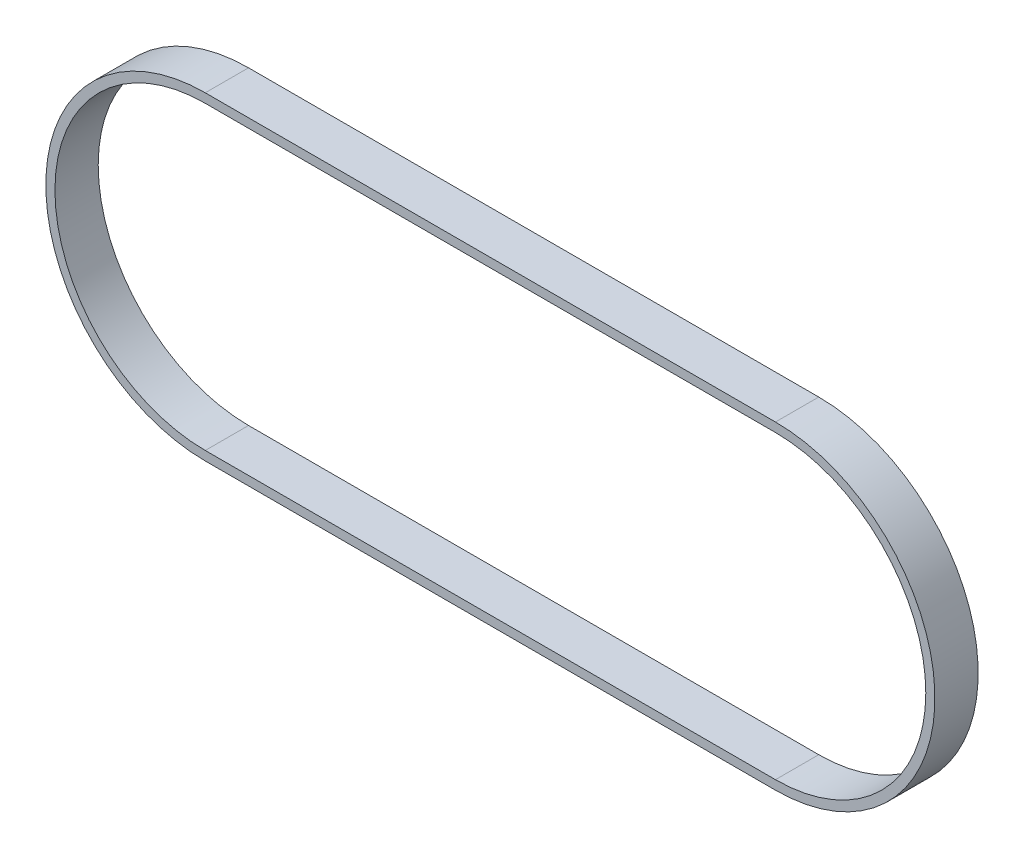
ISO-10303-21;
HEADER;
FILE_DESCRIPTION(('STEP AP214'),'2;1');
FILE_NAME('part.step','',(''),(''),'','','');
FILE_SCHEMA(('AUTOMOTIVE_DESIGN { 1 0 10303 214 1 1 1 1 }'));
ENDSEC;
DATA;
#1=APPLICATION_CONTEXT('core data for automotive mechanical design processes');
#2=APPLICATION_PROTOCOL_DEFINITION('international standard','automotive_design',2000,#1);
#3=PRODUCT_CONTEXT('',#1,'mechanical');
#4=PRODUCT('Part','Part','',(#3));
#5=PRODUCT_RELATED_PRODUCT_CATEGORY('part','',(#4));
#6=PRODUCT_DEFINITION_FORMATION('','',#4);
#7=PRODUCT_DEFINITION_CONTEXT('part definition',#1,'design');
#8=PRODUCT_DEFINITION('design','',#6,#7);
#9=PRODUCT_DEFINITION_SHAPE('','',#8);
#10=(LENGTH_UNIT() NAMED_UNIT(*) SI_UNIT(.MILLI.,.METRE.));
#11=(NAMED_UNIT(*) PLANE_ANGLE_UNIT() SI_UNIT($,.RADIAN.));
#12=(NAMED_UNIT(*) SI_UNIT($,.STERADIAN.) SOLID_ANGLE_UNIT());
#13=UNCERTAINTY_MEASURE_WITH_UNIT(LENGTH_MEASURE(1.E-05),#10,'distance_accuracy_value','');
#14=(GEOMETRIC_REPRESENTATION_CONTEXT(3) GLOBAL_UNCERTAINTY_ASSIGNED_CONTEXT((#13)) GLOBAL_UNIT_ASSIGNED_CONTEXT((#10,
#11,#12)) REPRESENTATION_CONTEXT('',''));
#15=CARTESIAN_POINT('',(0.,0.,0.));
#16=DIRECTION('',(0.,0.,1.));
#17=DIRECTION('',(1.,0.,0.));
#18=AXIS2_PLACEMENT_3D('',#15,#16,#17);
#19=CARTESIAN_POINT('',(0.,0.,-4.75));
#20=DIRECTION('',(0.,0.,1.));
#21=DIRECTION('',(1.,0.,0.));
#22=AXIS2_PLACEMENT_3D('',#19,#20,#21);
#23=CYLINDRICAL_SURFACE('',#22,35.);
#24=DIRECTION('',(0.,0.,1.));
#25=VECTOR('',#24,1.);
#26=CARTESIAN_POINT('',(0.,35.,-4.75));
#27=LINE('',#26,#25);
#28=CARTESIAN_POINT('',(0.,35.,-4.75));
#29=VERTEX_POINT('',#28);
#30=CARTESIAN_POINT('',(0.,35.,4.75));
#31=VERTEX_POINT('',#30);
#32=EDGE_CURVE('E84',#29,#31,#27,.T.);
#33=ORIENTED_EDGE('',*,*,#32,.T.);
#34=CARTESIAN_POINT('',(0.,0.,4.75));
#35=DIRECTION('',(0.,0.,-1.));
#36=DIRECTION('',(-1.,0.,0.));
#37=AXIS2_PLACEMENT_3D('',#34,#35,#36);
#38=CIRCLE('',#37,35.);
#39=CARTESIAN_POINT('',(0.,-35.,4.75));
#40=VERTEX_POINT('',#39);
#41=EDGE_CURVE('E176',#40,#31,#38,.F.);
#42=ORIENTED_EDGE('',*,*,#41,.F.);
#43=DIRECTION('',(0.,0.,1.));
#44=VECTOR('',#43,1.);
#45=CARTESIAN_POINT('',(0.,-35.,-4.75));
#46=LINE('',#45,#44);
#47=CARTESIAN_POINT('',(0.,-35.,-4.75));
#48=VERTEX_POINT('',#47);
#49=EDGE_CURVE('E12',#48,#40,#46,.T.);
#50=ORIENTED_EDGE('',*,*,#49,.F.);
#51=CARTESIAN_POINT('',(0.,0.,-4.75));
#52=DIRECTION('',(0.,0.,-1.));
#53=DIRECTION('',(-1.,0.,0.));
#54=AXIS2_PLACEMENT_3D('',#51,#52,#53);
#55=CIRCLE('',#54,35.);
#56=EDGE_CURVE('E195',#48,#29,#55,.F.);
#57=ORIENTED_EDGE('',*,*,#56,.T.);
#58=EDGE_LOOP('',(#33,#42,#50,#57));
#59=FACE_BOUND('',#58,.T.);
#60=ADVANCED_FACE('F81',(#59),#23,.T.);
#61=CARTESIAN_POINT('',(0.,-35.,-4.75));
#62=DIRECTION('',(0.,-1.,0.));
#63=DIRECTION('',(1.,0.,0.));
#64=AXIS2_PLACEMENT_3D('',#61,#62,#63);
#65=PLANE('',#64);
#66=ORIENTED_EDGE('',*,*,#49,.T.);
#67=DIRECTION('',(1.,0.,0.));
#68=VECTOR('',#67,1.);
#69=CARTESIAN_POINT('',(0.,-35.,4.75));
#70=LINE('',#69,#68);
#71=CARTESIAN_POINT('',(-125.18,-35.,4.75));
#72=VERTEX_POINT('',#71);
#73=EDGE_CURVE('E185',#72,#40,#70,.T.);
#74=ORIENTED_EDGE('',*,*,#73,.F.);
#75=DIRECTION('',(0.,0.,1.));
#76=VECTOR('',#75,1.);
#77=CARTESIAN_POINT('',(-125.18,-35.,-4.75));
#78=LINE('',#77,#76);
#79=CARTESIAN_POINT('',(-125.18,-35.,-4.75));
#80=VERTEX_POINT('',#79);
#81=EDGE_CURVE('E89',#80,#72,#78,.T.);
#82=ORIENTED_EDGE('',*,*,#81,.F.);
#83=DIRECTION('',(1.,0.,0.));
#84=VECTOR('',#83,1.);
#85=CARTESIAN_POINT('',(0.,-35.,-4.75));
#86=LINE('',#85,#84);
#87=EDGE_CURVE('E206',#80,#48,#86,.T.);
#88=ORIENTED_EDGE('',*,*,#87,.T.);
#89=EDGE_LOOP('',(#66,#74,#82,#88));
#90=FACE_BOUND('',#89,.T.);
#91=ADVANCED_FACE('F218',(#90),#65,.T.);
#92=CARTESIAN_POINT('',(-125.18,0.,-4.75));
#93=DIRECTION('',(0.,0.,1.));
#94=DIRECTION('',(1.,0.,0.));
#95=AXIS2_PLACEMENT_3D('',#92,#93,#94);
#96=CYLINDRICAL_SURFACE('',#95,35.);
#97=ORIENTED_EDGE('',*,*,#81,.T.);
#98=CARTESIAN_POINT('',(-125.18,0.,4.75));
#99=DIRECTION('',(0.,0.,-1.));
#100=DIRECTION('',(-1.,0.,0.));
#101=AXIS2_PLACEMENT_3D('',#98,#99,#100);
#102=CIRCLE('',#101,35.);
#103=CARTESIAN_POINT('',(-125.18,35.,4.75));
#104=VERTEX_POINT('',#103);
#105=EDGE_CURVE('E182',#104,#72,#102,.F.);
#106=ORIENTED_EDGE('',*,*,#105,.F.);
#107=DIRECTION('',(0.,0.,1.));
#108=VECTOR('',#107,1.);
#109=CARTESIAN_POINT('',(-125.18,35.,-4.75));
#110=LINE('',#109,#108);
#111=CARTESIAN_POINT('',(-125.18,35.,-4.75));
#112=VERTEX_POINT('',#111);
#113=EDGE_CURVE('E209',#112,#104,#110,.T.);
#114=ORIENTED_EDGE('',*,*,#113,.F.);
#115=CARTESIAN_POINT('',(-125.18,0.,-4.75));
#116=DIRECTION('',(0.,0.,-1.));
#117=DIRECTION('',(-1.,0.,0.));
#118=AXIS2_PLACEMENT_3D('',#115,#116,#117);
#119=CIRCLE('',#118,35.);
#120=EDGE_CURVE('E203',#112,#80,#119,.F.);
#121=ORIENTED_EDGE('',*,*,#120,.T.);
#122=EDGE_LOOP('',(#97,#106,#114,#121));
#123=FACE_BOUND('',#122,.T.);
#124=ADVANCED_FACE('F224',(#123),#96,.T.);
#125=CARTESIAN_POINT('',(0.,35.,-4.75));
#126=DIRECTION('',(0.,1.,0.));
#127=DIRECTION('',(-1.,0.,0.));
#128=AXIS2_PLACEMENT_3D('',#125,#126,#127);
#129=PLANE('',#128);
#130=ORIENTED_EDGE('',*,*,#113,.T.);
#131=DIRECTION('',(-1.,0.,0.));
#132=VECTOR('',#131,1.);
#133=CARTESIAN_POINT('',(0.,35.,4.75));
#134=LINE('',#133,#132);
#135=EDGE_CURVE('E179',#31,#104,#134,.T.);
#136=ORIENTED_EDGE('',*,*,#135,.F.);
#137=ORIENTED_EDGE('',*,*,#32,.F.);
#138=DIRECTION('',(-1.,0.,0.));
#139=VECTOR('',#138,1.);
#140=CARTESIAN_POINT('',(0.,35.,-4.75));
#141=LINE('',#140,#139);
#142=EDGE_CURVE('E200',#29,#112,#141,.T.);
#143=ORIENTED_EDGE('',*,*,#142,.T.);
#144=EDGE_LOOP('',(#130,#136,#137,#143));
#145=FACE_BOUND('',#144,.T.);
#146=ADVANCED_FACE('F213',(#145),#129,.T.);
#147=CARTESIAN_POINT('',(0.,0.,-4.75));
#148=DIRECTION('',(0.,0.,-1.));
#149=DIRECTION('',(-1.,0.,0.));
#150=AXIS2_PLACEMENT_3D('',#147,#148,#149);
#151=PLANE('',#150);
#152=CARTESIAN_POINT('',(0.,0.,-4.75));
#153=DIRECTION('',(0.,0.,-1.));
#154=DIRECTION('',(-1.,0.,0.));
#155=AXIS2_PLACEMENT_3D('',#152,#153,#154);
#156=CIRCLE('',#155,33.);
#157=CARTESIAN_POINT('',(0.,-33.,-4.75));
#158=VERTEX_POINT('',#157);
#159=CARTESIAN_POINT('',(0.,33.,-4.75));
#160=VERTEX_POINT('',#159);
#161=EDGE_CURVE('E188',#158,#160,#156,.F.);
#162=ORIENTED_EDGE('',*,*,#161,.T.);
#163=DIRECTION('',(-1.,0.,0.));
#164=VECTOR('',#163,1.);
#165=CARTESIAN_POINT('',(0.,33.,-4.75));
#166=LINE('',#165,#164);
#167=CARTESIAN_POINT('',(-125.18,33.,-4.75));
#168=VERTEX_POINT('',#167);
#169=EDGE_CURVE('E153',#160,#168,#166,.T.);
#170=ORIENTED_EDGE('',*,*,#169,.T.);
#171=CARTESIAN_POINT('',(-125.18,0.,-4.75));
#172=DIRECTION('',(0.,0.,-1.));
#173=DIRECTION('',(-1.,0.,0.));
#174=AXIS2_PLACEMENT_3D('',#171,#172,#173);
#175=CIRCLE('',#174,33.);
#176=CARTESIAN_POINT('',(-125.18,-33.,-4.75));
#177=VERTEX_POINT('',#176);
#178=EDGE_CURVE('E97',#168,#177,#175,.F.);
#179=ORIENTED_EDGE('',*,*,#178,.T.);
#180=DIRECTION('',(1.,0.,0.));
#181=VECTOR('',#180,1.);
#182=CARTESIAN_POINT('',(0.,-33.,-4.75));
#183=LINE('',#182,#181);
#184=EDGE_CURVE('E158',#177,#158,#183,.T.);
#185=ORIENTED_EDGE('',*,*,#184,.T.);
#186=EDGE_LOOP('',(#162,#170,#179,#185));
#187=FACE_BOUND('',#186,.T.);
#188=ORIENTED_EDGE('',*,*,#56,.F.);
#189=ORIENTED_EDGE('',*,*,#87,.F.);
#190=ORIENTED_EDGE('',*,*,#120,.F.);
#191=ORIENTED_EDGE('',*,*,#142,.F.);
#192=EDGE_LOOP('',(#188,#189,#190,#191));
#193=FACE_BOUND('',#192,.T.);
#194=ADVANCED_FACE('F222',(#187,#193),#151,.T.);
#195=CARTESIAN_POINT('',(0.,0.,-4.75));
#196=DIRECTION('',(0.,0.,1.));
#197=DIRECTION('',(1.,0.,0.));
#198=AXIS2_PLACEMENT_3D('',#195,#196,#197);
#199=CYLINDRICAL_SURFACE('',#198,33.);
#200=DIRECTION('',(0.,0.,1.));
#201=VECTOR('',#200,1.);
#202=CARTESIAN_POINT('',(0.,-33.,-4.75));
#203=LINE('',#202,#201);
#204=CARTESIAN_POINT('',(0.,-33.,4.75));
#205=VERTEX_POINT('',#204);
#206=EDGE_CURVE('E163',#158,#205,#203,.T.);
#207=ORIENTED_EDGE('',*,*,#206,.T.);
#208=CARTESIAN_POINT('',(0.,0.,4.75));
#209=DIRECTION('',(0.,0.,-1.));
#210=DIRECTION('',(-1.,0.,0.));
#211=AXIS2_PLACEMENT_3D('',#208,#209,#210);
#212=CIRCLE('',#211,33.);
#213=CARTESIAN_POINT('',(0.,33.,4.75));
#214=VERTEX_POINT('',#213);
#215=EDGE_CURVE('E161',#205,#214,#212,.F.);
#216=ORIENTED_EDGE('',*,*,#215,.T.);
#217=DIRECTION('',(0.,0.,1.));
#218=VECTOR('',#217,1.);
#219=CARTESIAN_POINT('',(0.,33.,-4.75));
#220=LINE('',#219,#218);
#221=EDGE_CURVE('E146',#160,#214,#220,.T.);
#222=ORIENTED_EDGE('',*,*,#221,.F.);
#223=ORIENTED_EDGE('',*,*,#161,.F.);
#224=EDGE_LOOP('',(#207,#216,#222,#223));
#225=FACE_BOUND('',#224,.T.);
#226=ADVANCED_FACE('F162',(#225),#199,.F.);
#227=CARTESIAN_POINT('',(0.,-33.,-4.75));
#228=DIRECTION('',(0.,-1.,0.));
#229=DIRECTION('',(1.,0.,0.));
#230=AXIS2_PLACEMENT_3D('',#227,#228,#229);
#231=PLANE('',#230);
#232=DIRECTION('',(0.,0.,1.));
#233=VECTOR('',#232,1.);
#234=CARTESIAN_POINT('',(-125.18,-33.,-4.75));
#235=LINE('',#234,#233);
#236=CARTESIAN_POINT('',(-125.18,-33.,4.75));
#237=VERTEX_POINT('',#236);
#238=EDGE_CURVE('E196',#177,#237,#235,.T.);
#239=ORIENTED_EDGE('',*,*,#238,.T.);
#240=DIRECTION('',(1.,0.,0.));
#241=VECTOR('',#240,1.);
#242=CARTESIAN_POINT('',(0.,-33.,4.75));
#243=LINE('',#242,#241);
#244=EDGE_CURVE('E172',#237,#205,#243,.T.);
#245=ORIENTED_EDGE('',*,*,#244,.T.);
#246=ORIENTED_EDGE('',*,*,#206,.F.);
#247=ORIENTED_EDGE('',*,*,#184,.F.);
#248=EDGE_LOOP('',(#239,#245,#246,#247));
#249=FACE_BOUND('',#248,.T.);
#250=ADVANCED_FACE('F267',(#249),#231,.F.);
#251=CARTESIAN_POINT('',(-125.18,0.,-4.75));
#252=DIRECTION('',(0.,0.,1.));
#253=DIRECTION('',(1.,0.,0.));
#254=AXIS2_PLACEMENT_3D('',#251,#252,#253);
#255=CYLINDRICAL_SURFACE('',#254,33.);
#256=DIRECTION('',(0.,0.,1.));
#257=VECTOR('',#256,1.);
#258=CARTESIAN_POINT('',(-125.18,33.,-4.75));
#259=LINE('',#258,#257);
#260=CARTESIAN_POINT('',(-125.18,33.,4.75));
#261=VERTEX_POINT('',#260);
#262=EDGE_CURVE('E157',#168,#261,#259,.T.);
#263=ORIENTED_EDGE('',*,*,#262,.T.);
#264=CARTESIAN_POINT('',(-125.18,0.,4.75));
#265=DIRECTION('',(0.,0.,-1.));
#266=DIRECTION('',(-1.,0.,0.));
#267=AXIS2_PLACEMENT_3D('',#264,#265,#266);
#268=CIRCLE('',#267,33.);
#269=EDGE_CURVE('E170',#261,#237,#268,.F.);
#270=ORIENTED_EDGE('',*,*,#269,.T.);
#271=ORIENTED_EDGE('',*,*,#238,.F.);
#272=ORIENTED_EDGE('',*,*,#178,.F.);
#273=EDGE_LOOP('',(#263,#270,#271,#272));
#274=FACE_BOUND('',#273,.T.);
#275=ADVANCED_FACE('F276',(#274),#255,.F.);
#276=CARTESIAN_POINT('',(0.,33.,-4.75));
#277=DIRECTION('',(0.,1.,0.));
#278=DIRECTION('',(-1.,0.,0.));
#279=AXIS2_PLACEMENT_3D('',#276,#277,#278);
#280=PLANE('',#279);
#281=ORIENTED_EDGE('',*,*,#221,.T.);
#282=DIRECTION('',(-1.,0.,0.));
#283=VECTOR('',#282,1.);
#284=CARTESIAN_POINT('',(0.,33.,4.75));
#285=LINE('',#284,#283);
#286=EDGE_CURVE('E150',#214,#261,#285,.T.);
#287=ORIENTED_EDGE('',*,*,#286,.T.);
#288=ORIENTED_EDGE('',*,*,#262,.F.);
#289=ORIENTED_EDGE('',*,*,#169,.F.);
#290=EDGE_LOOP('',(#281,#287,#288,#289));
#291=FACE_BOUND('',#290,.T.);
#292=ADVANCED_FACE('F148',(#291),#280,.F.);
#293=CARTESIAN_POINT('',(0.,0.,4.75));
#294=DIRECTION('',(0.,0.,-1.));
#295=DIRECTION('',(-1.,0.,0.));
#296=AXIS2_PLACEMENT_3D('',#293,#294,#295);
#297=PLANE('',#296);
#298=ORIENTED_EDGE('',*,*,#41,.T.);
#299=ORIENTED_EDGE('',*,*,#135,.T.);
#300=ORIENTED_EDGE('',*,*,#105,.T.);
#301=ORIENTED_EDGE('',*,*,#73,.T.);
#302=EDGE_LOOP('',(#298,#299,#300,#301));
#303=FACE_BOUND('',#302,.T.);
#304=ORIENTED_EDGE('',*,*,#215,.F.);
#305=ORIENTED_EDGE('',*,*,#244,.F.);
#306=ORIENTED_EDGE('',*,*,#269,.F.);
#307=ORIENTED_EDGE('',*,*,#286,.F.);
#308=EDGE_LOOP('',(#304,#305,#306,#307));
#309=FACE_BOUND('',#308,.T.);
#310=ADVANCED_FACE('F168',(#303,#309),#297,.F.);
#311=CLOSED_SHELL('',(#60,#91,#124,#146,#194,#226,#250,#275,#292,#310));
#312=MANIFOLD_SOLID_BREP('B2',#311);
#313=ADVANCED_BREP_SHAPE_REPRESENTATION('',(#18,#312),#14);
#314=SHAPE_DEFINITION_REPRESENTATION(#9,#313);
ENDSEC;
END-ISO-10303-21;
